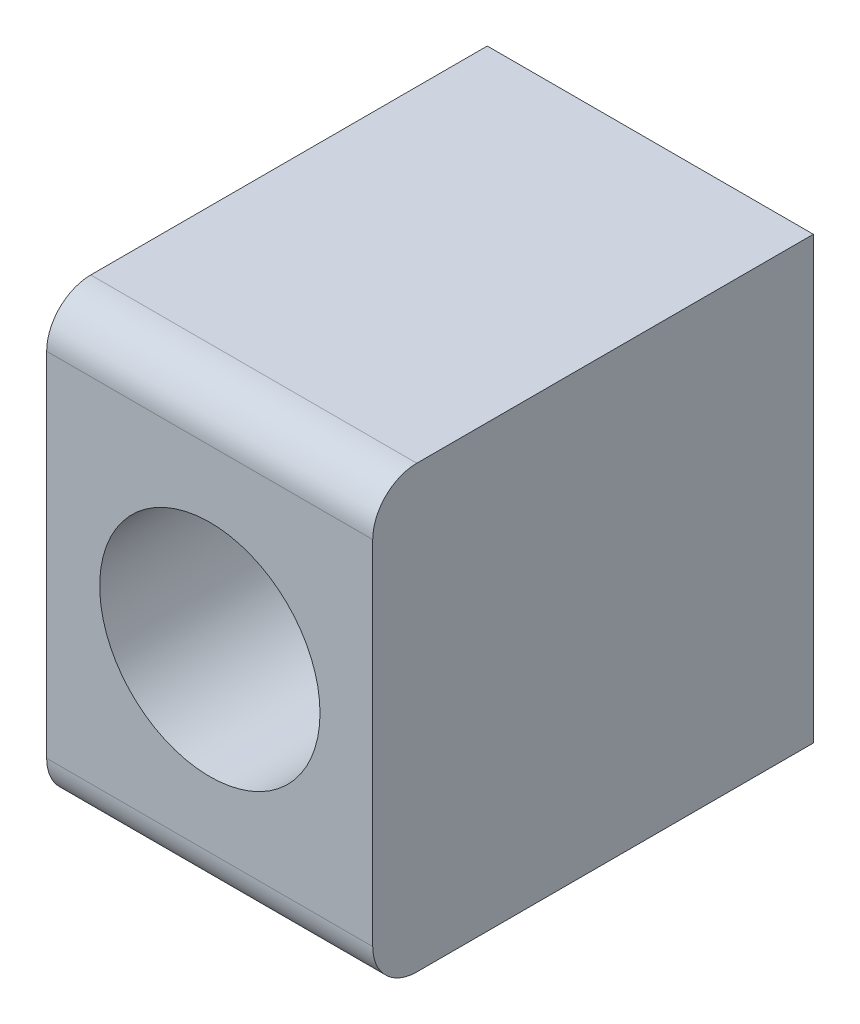
ISO-10303-21;
HEADER;
FILE_DESCRIPTION(('STEP AP214'),'2;1');
FILE_NAME('part.step','',(''),(''),'','','');
FILE_SCHEMA(('AUTOMOTIVE_DESIGN { 1 0 10303 214 1 1 1 1 }'));
ENDSEC;
DATA;
#1=APPLICATION_CONTEXT('core data for automotive mechanical design processes');
#2=APPLICATION_PROTOCOL_DEFINITION('international standard','automotive_design',2000,#1);
#3=PRODUCT_CONTEXT('',#1,'mechanical');
#4=PRODUCT('Part','Part','',(#3));
#5=PRODUCT_RELATED_PRODUCT_CATEGORY('part','',(#4));
#6=PRODUCT_DEFINITION_FORMATION('','',#4);
#7=PRODUCT_DEFINITION_CONTEXT('part definition',#1,'design');
#8=PRODUCT_DEFINITION('design','',#6,#7);
#9=PRODUCT_DEFINITION_SHAPE('','',#8);
#10=(LENGTH_UNIT() NAMED_UNIT(*) SI_UNIT(.MILLI.,.METRE.));
#11=(NAMED_UNIT(*) PLANE_ANGLE_UNIT() SI_UNIT($,.RADIAN.));
#12=(NAMED_UNIT(*) SI_UNIT($,.STERADIAN.) SOLID_ANGLE_UNIT());
#13=UNCERTAINTY_MEASURE_WITH_UNIT(LENGTH_MEASURE(1.E-05),#10,'distance_accuracy_value','');
#14=(GEOMETRIC_REPRESENTATION_CONTEXT(3) GLOBAL_UNCERTAINTY_ASSIGNED_CONTEXT((#13)) GLOBAL_UNIT_ASSIGNED_CONTEXT((#10,
#11,#12)) REPRESENTATION_CONTEXT('',''));
#15=CARTESIAN_POINT('',(0.,0.,0.));
#16=DIRECTION('',(0.,0.,1.));
#17=DIRECTION('',(1.,0.,0.));
#18=AXIS2_PLACEMENT_3D('',#15,#16,#17);
#19=CARTESIAN_POINT('',(-4.80582524271845,-15.4854368932039,20.));
#20=DIRECTION('',(0.,1.,0.));
#21=DIRECTION('',(0.,0.,1.));
#22=AXIS2_PLACEMENT_3D('',#19,#20,#21);
#23=PLANE('',#22);
#24=DIRECTION('',(0.,0.,-1.));
#25=VECTOR('',#24,1.);
#26=CARTESIAN_POINT('',(10.0941747572816,-15.4854368932039,18.));
#27=LINE('',#26,#25);
#28=CARTESIAN_POINT('',(10.0941747572816,-15.4854368932039,18.));
#29=VERTEX_POINT('',#28);
#30=CARTESIAN_POINT('',(10.0941747572816,-15.4854368932039,0.));
#31=VERTEX_POINT('',#30);
#32=EDGE_CURVE('E205',#29,#31,#27,.T.);
#33=ORIENTED_EDGE('',*,*,#32,.F.);
#34=CARTESIAN_POINT('',(-34.8058252427184,-15.4854368932039,18.));
#35=CARTESIAN_POINT('',(-24.8058252427184,-15.4854368932039,18.));
#36=CARTESIAN_POINT('',(-14.8058252427184,-15.4854368932039,18.));
#37=CARTESIAN_POINT('',(-4.80582524271845,-15.4854368932039,18.));
#38=CARTESIAN_POINT('',(0.194174757281553,-15.4854368932039,18.));
#39=CARTESIAN_POINT('',(5.19417475728155,-15.4854368932039,18.));
#40=CARTESIAN_POINT('',(10.1941747572816,-15.4854368932039,18.));
#41=CARTESIAN_POINT('',(20.1941747572816,-15.4854368932039,18.));
#42=CARTESIAN_POINT('',(30.1941747572816,-15.4854368932039,18.));
#43=CARTESIAN_POINT('',(40.1941747572816,-15.4854368932039,18.));
#44=(BOUNDED_CURVE() B_SPLINE_CURVE(3,(#34,#35,#36,#37,#38,#39,#40,#41,#42,#43),.UNSPECIFIED.,
.F.,.F.) B_SPLINE_CURVE_WITH_KNOTS((4,3,3,4),(-0.03,0.,0.015,0.045),
.UNSPECIFIED.) CURVE() GEOMETRIC_REPRESENTATION_ITEM() RATIONAL_B_SPLINE_CURVE((1.,1.,1.,1.,1.,
1.,1.,1.,1.,1.)) REPRESENTATION_ITEM(''));
#45=CARTESIAN_POINT('',(-4.70582524271845,-15.4854368932039,18.));
#46=VERTEX_POINT('',#45);
#47=EDGE_CURVE('E56',#29,#46,#44,.F.);
#48=ORIENTED_EDGE('',*,*,#47,.T.);
#49=DIRECTION('',(0.,0.,1.));
#50=VECTOR('',#49,1.);
#51=CARTESIAN_POINT('',(-4.70582524271845,-15.4854368932039,0.));
#52=LINE('',#51,#50);
#53=CARTESIAN_POINT('',(-4.70582524271845,-15.4854368932039,0.));
#54=VERTEX_POINT('',#53);
#55=EDGE_CURVE('E171',#54,#46,#52,.T.);
#56=ORIENTED_EDGE('',*,*,#55,.F.);
#57=DIRECTION('',(1.,0.,0.));
#58=VECTOR('',#57,1.);
#59=CARTESIAN_POINT('',(-4.80582524271845,-15.4854368932039,0.));
#60=LINE('',#59,#58);
#61=EDGE_CURVE('E124',#54,#31,#60,.T.);
#62=ORIENTED_EDGE('',*,*,#61,.T.);
#63=EDGE_LOOP('',(#33,#48,#56,#62));
#64=FACE_BOUND('',#63,.T.);
#65=ADVANCED_FACE('F43',(#64),#23,.F.);
#66=CARTESIAN_POINT('',(-4.80582524271845,4.51456310679611,20.));
#67=DIRECTION('',(0.,-1.,0.));
#68=DIRECTION('',(0.,0.,-1.));
#69=AXIS2_PLACEMENT_3D('',#66,#67,#68);
#70=PLANE('',#69);
#71=DIRECTION('',(0.,0.,1.));
#72=VECTOR('',#71,1.);
#73=CARTESIAN_POINT('',(10.0941747572816,4.51456310679611,0.));
#74=LINE('',#73,#72);
#75=CARTESIAN_POINT('',(10.0941747572816,4.51456310679611,0.));
#76=VERTEX_POINT('',#75);
#77=CARTESIAN_POINT('',(10.0941747572815,4.51456310679611,18.));
#78=VERTEX_POINT('',#77);
#79=EDGE_CURVE('E64',#76,#78,#74,.T.);
#80=ORIENTED_EDGE('',*,*,#79,.F.);
#81=DIRECTION('',(-1.,0.,0.));
#82=VECTOR('',#81,1.);
#83=CARTESIAN_POINT('',(-4.80582524271845,4.51456310679611,0.));
#84=LINE('',#83,#82);
#85=CARTESIAN_POINT('',(-4.70582524271845,4.51456310679611,0.));
#86=VERTEX_POINT('',#85);
#87=EDGE_CURVE('E119',#76,#86,#84,.T.);
#88=ORIENTED_EDGE('',*,*,#87,.T.);
#89=DIRECTION('',(0.,0.,-1.));
#90=VECTOR('',#89,1.);
#91=CARTESIAN_POINT('',(-4.70582524271845,4.51456310679611,18.));
#92=LINE('',#91,#90);
#93=CARTESIAN_POINT('',(-4.70582524271845,4.51456310679611,18.));
#94=VERTEX_POINT('',#93);
#95=EDGE_CURVE('E160',#94,#86,#92,.T.);
#96=ORIENTED_EDGE('',*,*,#95,.F.);
#97=CARTESIAN_POINT('',(40.1941747572816,4.51456310679611,18.));
#98=CARTESIAN_POINT('',(30.1941747572816,4.51456310679611,18.));
#99=CARTESIAN_POINT('',(20.1941747572815,4.51456310679611,18.));
#100=CARTESIAN_POINT('',(10.1941747572815,4.51456310679611,18.));
#101=CARTESIAN_POINT('',(5.19417475728155,4.51456310679611,18.));
#102=CARTESIAN_POINT('',(0.19417475728155,4.51456310679611,18.));
#103=CARTESIAN_POINT('',(-4.80582524271845,4.51456310679611,18.));
#104=CARTESIAN_POINT('',(-14.8058252427185,4.51456310679611,18.));
#105=CARTESIAN_POINT('',(-24.8058252427184,4.51456310679611,18.));
#106=CARTESIAN_POINT('',(-34.8058252427184,4.51456310679611,18.));
#107=(BOUNDED_CURVE() B_SPLINE_CURVE(3,(#97,#98,#99,#100,#101,#102,#103,#104,#105,#106),
.UNSPECIFIED.,.F.,.F.) B_SPLINE_CURVE_WITH_KNOTS((4,3,3,4),(-0.045,-0.015,0.,0.03),
.UNSPECIFIED.) CURVE() GEOMETRIC_REPRESENTATION_ITEM() RATIONAL_B_SPLINE_CURVE((1.,1.,1.,1.,1.,
1.,1.,1.,1.,1.)) REPRESENTATION_ITEM(''));
#108=EDGE_CURVE('E11',#94,#78,#107,.F.);
#109=ORIENTED_EDGE('',*,*,#108,.T.);
#110=EDGE_LOOP('',(#80,#88,#96,#109));
#111=FACE_BOUND('',#110,.T.);
#112=ADVANCED_FACE('F229',(#111),#70,.F.);
#113=CARTESIAN_POINT('',(0.,0.,20.));
#114=DIRECTION('',(0.,0.,1.));
#115=DIRECTION('',(1.,0.,0.));
#116=AXIS2_PLACEMENT_3D('',#113,#114,#115);
#117=PLANE('',#116);
#118=CARTESIAN_POINT('',(2.70143828103642,-5.50314069611968,20.));
#119=DIRECTION('',(0.,0.,1.));
#120=DIRECTION('',(1.,0.,0.));
#121=AXIS2_PLACEMENT_3D('',#118,#119,#120);
#122=CIRCLE('',#121,5.);
#123=CARTESIAN_POINT('',(7.70143828103642,-5.50314069611968,20.));
#124=VERTEX_POINT('',#123);
#125=EDGE_CURVE('E193',#124,#124,#122,.T.);
#126=ORIENTED_EDGE('',*,*,#125,.F.);
#127=EDGE_LOOP('',(#126));
#128=FACE_BOUND('',#127,.T.);
#129=CARTESIAN_POINT('',(-34.8058252427184,-13.4854368932039,20.));
#130=CARTESIAN_POINT('',(-24.8058252427184,-13.4854368932039,20.));
#131=CARTESIAN_POINT('',(-14.8058252427184,-13.4854368932039,20.));
#132=CARTESIAN_POINT('',(-4.80582524271845,-13.4854368932039,20.));
#133=CARTESIAN_POINT('',(0.194174757281552,-13.4854368932039,20.));
#134=CARTESIAN_POINT('',(5.19417475728155,-13.4854368932039,20.));
#135=CARTESIAN_POINT('',(10.1941747572816,-13.4854368932039,20.));
#136=CARTESIAN_POINT('',(20.1941747572816,-13.4854368932039,20.));
#137=CARTESIAN_POINT('',(30.1941747572816,-13.4854368932039,20.));
#138=CARTESIAN_POINT('',(40.1941747572816,-13.4854368932039,20.));
#139=(BOUNDED_CURVE() B_SPLINE_CURVE(3,(#129,#130,#131,#132,#133,#134,#135,#136,#137,#138),
.UNSPECIFIED.,.F.,.F.) B_SPLINE_CURVE_WITH_KNOTS((4,3,3,4),(-0.03,0.,0.015,0.045),
.UNSPECIFIED.) CURVE() GEOMETRIC_REPRESENTATION_ITEM() RATIONAL_B_SPLINE_CURVE((1.,1.,1.,1.,1.,
1.,1.,1.,1.,1.)) REPRESENTATION_ITEM(''));
#140=CARTESIAN_POINT('',(-4.70582524271845,-13.4854368932039,20.));
#141=VERTEX_POINT('',#140);
#142=CARTESIAN_POINT('',(10.0941747572816,-13.4854368932039,20.));
#143=VERTEX_POINT('',#142);
#144=EDGE_CURVE('E112',#141,#143,#139,.T.);
#145=ORIENTED_EDGE('',*,*,#144,.T.);
#146=DIRECTION('',(0.,-1.,0.));
#147=VECTOR('',#146,1.);
#148=CARTESIAN_POINT('',(10.0941747572816,2.51456310679611,20.));
#149=LINE('',#148,#147);
#150=CARTESIAN_POINT('',(10.0941747572816,2.51456310679611,20.));
#151=VERTEX_POINT('',#150);
#152=EDGE_CURVE('E103',#151,#143,#149,.T.);
#153=ORIENTED_EDGE('',*,*,#152,.F.);
#154=CARTESIAN_POINT('',(40.1941747572816,2.51456310679611,20.));
#155=CARTESIAN_POINT('',(30.1941747572816,2.51456310679611,20.));
#156=CARTESIAN_POINT('',(20.1941747572815,2.51456310679611,20.));
#157=CARTESIAN_POINT('',(10.1941747572815,2.51456310679611,20.));
#158=CARTESIAN_POINT('',(5.19417475728155,2.51456310679611,20.));
#159=CARTESIAN_POINT('',(0.19417475728155,2.51456310679611,20.));
#160=CARTESIAN_POINT('',(-4.80582524271845,2.51456310679611,20.));
#161=CARTESIAN_POINT('',(-14.8058252427185,2.51456310679611,20.));
#162=CARTESIAN_POINT('',(-24.8058252427184,2.51456310679611,20.));
#163=CARTESIAN_POINT('',(-34.8058252427184,2.51456310679611,20.));
#164=(BOUNDED_CURVE() B_SPLINE_CURVE(3,(#154,#155,#156,#157,#158,#159,#160,#161,#162,#163),
.UNSPECIFIED.,.F.,.F.) B_SPLINE_CURVE_WITH_KNOTS((4,3,3,4),(-0.045,-0.015,0.,0.03),
.UNSPECIFIED.) CURVE() GEOMETRIC_REPRESENTATION_ITEM() RATIONAL_B_SPLINE_CURVE((1.,1.,1.,1.,1.,
1.,1.,1.,1.,1.)) REPRESENTATION_ITEM(''));
#165=CARTESIAN_POINT('',(-4.70582524271845,2.51456310679611,20.));
#166=VERTEX_POINT('',#165);
#167=EDGE_CURVE('E72',#151,#166,#164,.T.);
#168=ORIENTED_EDGE('',*,*,#167,.T.);
#169=DIRECTION('',(0.,1.,0.));
#170=VECTOR('',#169,1.);
#171=CARTESIAN_POINT('',(-4.70582524271845,-13.4854368932039,20.));
#172=LINE('',#171,#170);
#173=EDGE_CURVE('E152',#141,#166,#172,.T.);
#174=ORIENTED_EDGE('',*,*,#173,.F.);
#175=EDGE_LOOP('',(#145,#153,#168,#174));
#176=FACE_BOUND('',#175,.T.);
#177=ADVANCED_FACE('F110',(#128,#176),#117,.T.);
#178=CARTESIAN_POINT('',(0.,0.,0.));
#179=DIRECTION('',(0.,0.,1.));
#180=DIRECTION('',(1.,0.,0.));
#181=AXIS2_PLACEMENT_3D('',#178,#179,#180);
#182=PLANE('',#181);
#183=CARTESIAN_POINT('',(2.70143828103642,-5.50314069611968,0.));
#184=DIRECTION('',(0.,0.,1.));
#185=DIRECTION('',(1.,0.,0.));
#186=AXIS2_PLACEMENT_3D('',#183,#184,#185);
#187=CIRCLE('',#186,2.75);
#188=CARTESIAN_POINT('',(5.45143828103642,-5.50314069611968,0.));
#189=VERTEX_POINT('',#188);
#190=EDGE_CURVE('E166',#189,#189,#187,.T.);
#191=ORIENTED_EDGE('',*,*,#190,.T.);
#192=EDGE_LOOP('',(#191));
#193=FACE_BOUND('',#192,.T.);
#194=DIRECTION('',(0.,1.,0.));
#195=VECTOR('',#194,1.);
#196=CARTESIAN_POINT('',(10.0941747572816,-15.4854368932039,0.));
#197=LINE('',#196,#195);
#198=EDGE_CURVE('E183',#31,#76,#197,.T.);
#199=ORIENTED_EDGE('',*,*,#198,.F.);
#200=ORIENTED_EDGE('',*,*,#61,.F.);
#201=DIRECTION('',(0.,-1.,0.));
#202=VECTOR('',#201,1.);
#203=CARTESIAN_POINT('',(-4.70582524271845,4.51456310679611,0.));
#204=LINE('',#203,#202);
#205=EDGE_CURVE('E175',#86,#54,#204,.T.);
#206=ORIENTED_EDGE('',*,*,#205,.F.);
#207=ORIENTED_EDGE('',*,*,#87,.F.);
#208=EDGE_LOOP('',(#199,#200,#206,#207));
#209=FACE_BOUND('',#208,.T.);
#210=ADVANCED_FACE('F209',(#193,#209),#182,.F.);
#211=CARTESIAN_POINT('',(-7.80582524271845,-13.4854368932039,20.));
#212=CARTESIAN_POINT('',(-6.80582524271845,-13.4854368932039,20.));
#213=CARTESIAN_POINT('',(-5.80582524271845,-13.4854368932039,20.));
#214=CARTESIAN_POINT('',(-4.80582524271845,-13.4854368932039,20.));
#215=CARTESIAN_POINT('',(0.194174757281552,-13.4854368932039,20.));
#216=CARTESIAN_POINT('',(5.19417475728155,-13.4854368932039,20.));
#217=CARTESIAN_POINT('',(10.1941747572816,-13.4854368932039,20.));
#218=CARTESIAN_POINT('',(11.1941747572816,-13.4854368932039,20.));
#219=CARTESIAN_POINT('',(12.1941747572816,-13.4854368932039,20.));
#220=CARTESIAN_POINT('',(13.1941747572816,-13.4854368932039,20.));
#221=CARTESIAN_POINT('',(-7.80582524271845,-15.4854368932039,20.));
#222=CARTESIAN_POINT('',(-6.80582524271845,-15.4854368932039,20.));
#223=CARTESIAN_POINT('',(-5.80582524271845,-15.4854368932039,20.));
#224=CARTESIAN_POINT('',(-4.80582524271845,-15.4854368932039,20.));
#225=CARTESIAN_POINT('',(0.194174757281553,-15.4854368932039,20.));
#226=CARTESIAN_POINT('',(5.19417475728155,-15.4854368932039,20.));
#227=CARTESIAN_POINT('',(10.1941747572816,-15.4854368932039,20.));
#228=CARTESIAN_POINT('',(11.1941747572816,-15.4854368932039,20.));
#229=CARTESIAN_POINT('',(12.1941747572816,-15.4854368932039,20.));
#230=CARTESIAN_POINT('',(13.1941747572816,-15.4854368932039,20.));
#231=CARTESIAN_POINT('',(-7.80582524271845,-15.4854368932039,18.));
#232=CARTESIAN_POINT('',(-6.80582524271845,-15.4854368932039,18.));
#233=CARTESIAN_POINT('',(-5.80582524271845,-15.4854368932039,18.));
#234=CARTESIAN_POINT('',(-4.80582524271845,-15.4854368932039,18.));
#235=CARTESIAN_POINT('',(0.194174757281553,-15.4854368932039,18.));
#236=CARTESIAN_POINT('',(5.19417475728155,-15.4854368932039,18.));
#237=CARTESIAN_POINT('',(10.1941747572816,-15.4854368932039,18.));
#238=CARTESIAN_POINT('',(11.1941747572816,-15.4854368932039,18.));
#239=CARTESIAN_POINT('',(12.1941747572816,-15.4854368932039,18.));
#240=CARTESIAN_POINT('',(13.1941747572816,-15.4854368932039,18.));
#241=(BOUNDED_SURFACE() B_SPLINE_SURFACE(2,3,((#211,#212,#213,#214,#215,#216,#217,#218,#219,
#220),(#221,#222,#223,#224,#225,#226,#227,#228,#229,#230),(#231,#232,#233,#234,#235,#236,#237,
#238,#239,#240)),.UNSPECIFIED.,.F.,.F.,.F.) B_SPLINE_SURFACE_WITH_KNOTS((3,3),(4,3,3,4),(0.,1.),
(-0.00300000000000001,0.,0.015,0.018),
.UNSPECIFIED.) GEOMETRIC_REPRESENTATION_ITEM() RATIONAL_B_SPLINE_SURFACE(((1.,1.,1.,1.,1.,1.,1.,
1.,1.,1.),(0.707106781186548,0.707106781186548,0.707106781186548,0.707106781186548,
0.707106781186548,0.707106781186548,0.707106781186548,0.707106781186548,0.707106781186548,
0.707106781186548),(1.,1.,1.,1.,1.,1.,1.,1.,1.,1.))) REPRESENTATION_ITEM('') SURFACE());
#242=CARTESIAN_POINT('',(10.0941747572816,-13.4854368932039,18.));
#243=DIRECTION('',(1.,0.,0.));
#244=DIRECTION('',(0.,1.,0.));
#245=AXIS2_PLACEMENT_3D('',#242,#243,#244);
#246=CIRCLE('',#245,2.);
#247=EDGE_CURVE('E114',#143,#29,#246,.T.);
#248=CARTESIAN_POINT('',(-4.70582524271845,-13.4854368932039,18.));
#249=DIRECTION('',(-1.,0.,0.));
#250=DIRECTION('',(0.,-1.,0.));
#251=AXIS2_PLACEMENT_3D('',#248,#249,#250);
#252=CIRCLE('',#251,2.00000000000001);
#253=EDGE_CURVE('E155',#46,#141,#252,.T.);
#254=ORIENTED_EDGE('',*,*,#47,.F.);
#255=ORIENTED_EDGE('',*,*,#247,.F.);
#256=ORIENTED_EDGE('',*,*,#144,.F.);
#257=ORIENTED_EDGE('',*,*,#253,.F.);
#258=EDGE_LOOP('',(#254,#255,#256,#257));
#259=FACE_BOUND('',#258,.T.);
#260=ADVANCED_FACE('F224',(#259),#241,.T.);
#261=CARTESIAN_POINT('',(13.1941747572816,2.51456310679611,20.));
#262=CARTESIAN_POINT('',(12.1941747572816,2.51456310679611,20.));
#263=CARTESIAN_POINT('',(11.1941747572816,2.51456310679611,20.));
#264=CARTESIAN_POINT('',(10.1941747572815,2.51456310679611,20.));
#265=CARTESIAN_POINT('',(5.19417475728155,2.51456310679611,20.));
#266=CARTESIAN_POINT('',(0.19417475728155,2.51456310679611,20.));
#267=CARTESIAN_POINT('',(-4.80582524271845,2.51456310679611,20.));
#268=CARTESIAN_POINT('',(-5.80582524271845,2.51456310679611,20.));
#269=CARTESIAN_POINT('',(-6.80582524271845,2.51456310679611,20.));
#270=CARTESIAN_POINT('',(-7.80582524271845,2.51456310679611,20.));
#271=CARTESIAN_POINT('',(13.1941747572816,4.51456310679611,20.));
#272=CARTESIAN_POINT('',(12.1941747572816,4.51456310679611,20.));
#273=CARTESIAN_POINT('',(11.1941747572816,4.51456310679611,20.));
#274=CARTESIAN_POINT('',(10.1941747572815,4.51456310679611,20.));
#275=CARTESIAN_POINT('',(5.19417475728155,4.51456310679611,20.));
#276=CARTESIAN_POINT('',(0.19417475728155,4.51456310679611,20.));
#277=CARTESIAN_POINT('',(-4.80582524271845,4.51456310679611,20.));
#278=CARTESIAN_POINT('',(-5.80582524271845,4.51456310679611,20.));
#279=CARTESIAN_POINT('',(-6.80582524271845,4.51456310679612,20.));
#280=CARTESIAN_POINT('',(-7.80582524271845,4.51456310679612,20.));
#281=CARTESIAN_POINT('',(13.1941747572816,4.51456310679611,18.));
#282=CARTESIAN_POINT('',(12.1941747572816,4.51456310679611,18.));
#283=CARTESIAN_POINT('',(11.1941747572816,4.51456310679611,18.));
#284=CARTESIAN_POINT('',(10.1941747572815,4.51456310679611,18.));
#285=CARTESIAN_POINT('',(5.19417475728155,4.51456310679611,18.));
#286=CARTESIAN_POINT('',(0.19417475728155,4.51456310679611,18.));
#287=CARTESIAN_POINT('',(-4.80582524271845,4.51456310679611,18.));
#288=CARTESIAN_POINT('',(-5.80582524271845,4.51456310679611,18.));
#289=CARTESIAN_POINT('',(-6.80582524271845,4.51456310679611,18.));
#290=CARTESIAN_POINT('',(-7.80582524271845,4.51456310679611,18.));
#291=(BOUNDED_SURFACE() B_SPLINE_SURFACE(2,3,((#261,#262,#263,#264,#265,#266,#267,#268,#269,
#270),(#271,#272,#273,#274,#275,#276,#277,#278,#279,#280),(#281,#282,#283,#284,#285,#286,#287,
#288,#289,#290)),.UNSPECIFIED.,.F.,.F.,.F.) B_SPLINE_SURFACE_WITH_KNOTS((3,3),(4,3,3,4),(0.,1.),
(-0.018,-0.015,0.,0.003),
.UNSPECIFIED.) GEOMETRIC_REPRESENTATION_ITEM() RATIONAL_B_SPLINE_SURFACE(((1.,1.,1.,1.,1.,1.,1.,
1.,1.,1.),(0.707106781186548,0.707106781186548,0.707106781186548,0.707106781186548,
0.707106781186548,0.707106781186548,0.707106781186548,0.707106781186547,0.707106781186547,
0.707106781186547),(1.,1.,1.,1.,1.,1.,1.,1.,1.,1.))) REPRESENTATION_ITEM('') SURFACE());
#292=CARTESIAN_POINT('',(10.0941747572816,2.51456310679612,18.));
#293=DIRECTION('',(1.,0.,0.));
#294=DIRECTION('',(0.,1.,0.));
#295=AXIS2_PLACEMENT_3D('',#292,#293,#294);
#296=CIRCLE('',#295,1.99999999999999);
#297=EDGE_CURVE('E101',#78,#151,#296,.T.);
#298=CARTESIAN_POINT('',(-4.70582524271845,2.51456310679612,18.));
#299=DIRECTION('',(-1.,0.,0.));
#300=DIRECTION('',(0.,-1.,0.));
#301=AXIS2_PLACEMENT_3D('',#298,#299,#300);
#302=CIRCLE('',#301,2.);
#303=EDGE_CURVE('E117',#166,#94,#302,.T.);
#304=ORIENTED_EDGE('',*,*,#167,.F.);
#305=ORIENTED_EDGE('',*,*,#297,.F.);
#306=ORIENTED_EDGE('',*,*,#108,.F.);
#307=ORIENTED_EDGE('',*,*,#303,.F.);
#308=EDGE_LOOP('',(#304,#305,#306,#307));
#309=FACE_BOUND('',#308,.T.);
#310=ADVANCED_FACE('F46',(#309),#291,.T.);
#311=CARTESIAN_POINT('',(2.70143828103642,-5.50314069611968,4.));
#312=DIRECTION('',(0.,0.,1.));
#313=DIRECTION('',(1.,0.,0.));
#314=AXIS2_PLACEMENT_3D('',#311,#312,#313);
#315=CYLINDRICAL_SURFACE('',#314,5.);
#316=CARTESIAN_POINT('',(2.70143828103642,-5.50314069611968,4.));
#317=DIRECTION('',(0.,0.,1.));
#318=DIRECTION('',(1.,0.,0.));
#319=AXIS2_PLACEMENT_3D('',#316,#317,#318);
#320=CIRCLE('',#319,5.);
#321=CARTESIAN_POINT('',(7.70143828103642,-5.50314069611968,4.));
#322=VERTEX_POINT('',#321);
#323=EDGE_CURVE('E194',#322,#322,#320,.T.);
#324=ORIENTED_EDGE('',*,*,#323,.F.);
#325=EDGE_LOOP('',(#324));
#326=FACE_BOUND('',#325,.T.);
#327=ORIENTED_EDGE('',*,*,#125,.T.);
#328=EDGE_LOOP('',(#327));
#329=FACE_BOUND('',#328,.T.);
#330=ADVANCED_FACE('F255',(#326,#329),#315,.F.);
#331=CARTESIAN_POINT('',(2.70143828103642,-5.50314069611968,4.));
#332=DIRECTION('',(0.,0.,1.));
#333=DIRECTION('',(1.,0.,0.));
#334=AXIS2_PLACEMENT_3D('',#331,#332,#333);
#335=PLANE('',#334);
#336=CARTESIAN_POINT('',(2.70143828103642,-5.50314069611968,4.));
#337=DIRECTION('',(0.,0.,1.));
#338=DIRECTION('',(1.,0.,0.));
#339=AXIS2_PLACEMENT_3D('',#336,#337,#338);
#340=CIRCLE('',#339,2.75);
#341=CARTESIAN_POINT('',(5.45143828103642,-5.50314069611968,4.));
#342=VERTEX_POINT('',#341);
#343=EDGE_CURVE('E189',#342,#342,#340,.T.);
#344=ORIENTED_EDGE('',*,*,#343,.F.);
#345=EDGE_LOOP('',(#344));
#346=FACE_BOUND('',#345,.T.);
#347=ORIENTED_EDGE('',*,*,#323,.T.);
#348=EDGE_LOOP('',(#347));
#349=FACE_BOUND('',#348,.T.);
#350=ADVANCED_FACE('F263',(#346,#349),#335,.T.);
#351=CARTESIAN_POINT('',(2.70143828103642,-5.50314069611968,0.));
#352=DIRECTION('',(0.,0.,1.));
#353=DIRECTION('',(1.,0.,0.));
#354=AXIS2_PLACEMENT_3D('',#351,#352,#353);
#355=CYLINDRICAL_SURFACE('',#354,2.75);
#356=ORIENTED_EDGE('',*,*,#343,.T.);
#357=EDGE_LOOP('',(#356));
#358=FACE_BOUND('',#357,.T.);
#359=ORIENTED_EDGE('',*,*,#190,.F.);
#360=EDGE_LOOP('',(#359));
#361=FACE_BOUND('',#360,.T.);
#362=ADVANCED_FACE('F261',(#358,#361),#355,.F.);
#363=CARTESIAN_POINT('',(-4.70582524271845,-13.4854368932039,18.));
#364=DIRECTION('',(-1.,0.,0.));
#365=DIRECTION('',(0.,-1.,0.));
#366=AXIS2_PLACEMENT_3D('',#363,#364,#365);
#367=PLANE('',#366);
#368=ORIENTED_EDGE('',*,*,#205,.T.);
#369=ORIENTED_EDGE('',*,*,#55,.T.);
#370=ORIENTED_EDGE('',*,*,#253,.T.);
#371=ORIENTED_EDGE('',*,*,#173,.T.);
#372=ORIENTED_EDGE('',*,*,#303,.T.);
#373=ORIENTED_EDGE('',*,*,#95,.T.);
#374=EDGE_LOOP('',(#368,#369,#370,#371,#372,#373));
#375=FACE_BOUND('',#374,.T.);
#376=ADVANCED_FACE('F226',(#375),#367,.T.);
#377=CARTESIAN_POINT('',(10.0941747572816,2.51456310679612,18.));
#378=DIRECTION('',(1.,0.,0.));
#379=DIRECTION('',(0.,1.,0.));
#380=AXIS2_PLACEMENT_3D('',#377,#378,#379);
#381=PLANE('',#380);
#382=ORIENTED_EDGE('',*,*,#297,.T.);
#383=ORIENTED_EDGE('',*,*,#152,.T.);
#384=ORIENTED_EDGE('',*,*,#247,.T.);
#385=ORIENTED_EDGE('',*,*,#32,.T.);
#386=ORIENTED_EDGE('',*,*,#198,.T.);
#387=ORIENTED_EDGE('',*,*,#79,.T.);
#388=EDGE_LOOP('',(#382,#383,#384,#385,#386,#387));
#389=FACE_BOUND('',#388,.T.);
#390=ADVANCED_FACE('F102',(#389),#381,.T.);
#391=CLOSED_SHELL('',(#65,#112,#177,#210,#260,#310,#330,#350,#362,#376,#390));
#392=MANIFOLD_SOLID_BREP('B2',#391);
#393=ADVANCED_BREP_SHAPE_REPRESENTATION('',(#18,#392),#14);
#394=SHAPE_DEFINITION_REPRESENTATION(#9,#393);
ENDSEC;
END-ISO-10303-21;
